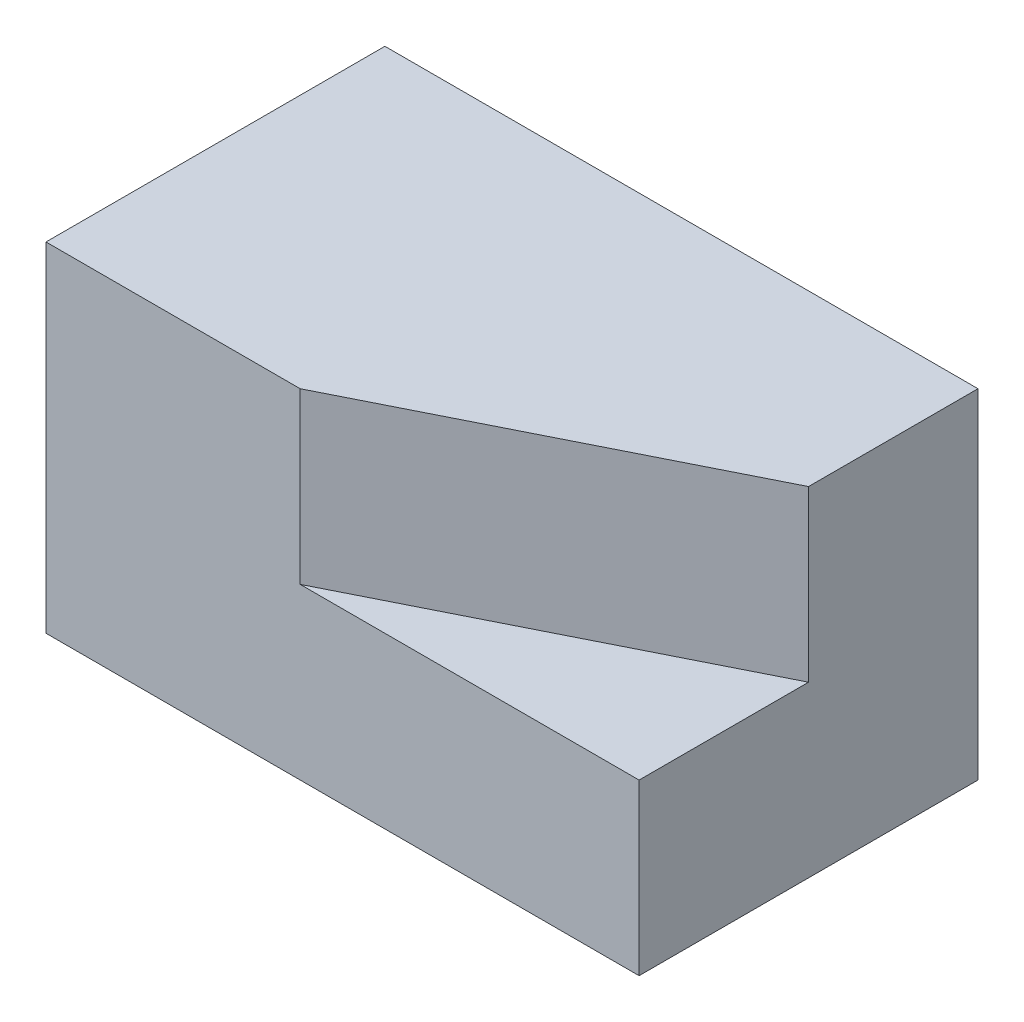
ISO-10303-21;
HEADER;
FILE_DESCRIPTION(('STEP AP214'),'2;1');
FILE_NAME('part.step','',(''),(''),'','','');
FILE_SCHEMA(('AUTOMOTIVE_DESIGN { 1 0 10303 214 1 1 1 1 }'));
ENDSEC;
DATA;
#1=APPLICATION_CONTEXT('core data for automotive mechanical design processes');
#2=APPLICATION_PROTOCOL_DEFINITION('international standard','automotive_design',2000,#1);
#3=PRODUCT_CONTEXT('',#1,'mechanical');
#4=PRODUCT('Part','Part','',(#3));
#5=PRODUCT_RELATED_PRODUCT_CATEGORY('part','',(#4));
#6=PRODUCT_DEFINITION_FORMATION('','',#4);
#7=PRODUCT_DEFINITION_CONTEXT('part definition',#1,'design');
#8=PRODUCT_DEFINITION('design','',#6,#7);
#9=PRODUCT_DEFINITION_SHAPE('','',#8);
#10=(LENGTH_UNIT() NAMED_UNIT(*) SI_UNIT(.MILLI.,.METRE.));
#11=(NAMED_UNIT(*) PLANE_ANGLE_UNIT() SI_UNIT($,.RADIAN.));
#12=(NAMED_UNIT(*) SI_UNIT($,.STERADIAN.) SOLID_ANGLE_UNIT());
#13=UNCERTAINTY_MEASURE_WITH_UNIT(LENGTH_MEASURE(1.E-05),#10,'distance_accuracy_value','');
#14=(GEOMETRIC_REPRESENTATION_CONTEXT(3) GLOBAL_UNCERTAINTY_ASSIGNED_CONTEXT((#13)) GLOBAL_UNIT_ASSIGNED_CONTEXT((#10,
#11,#12)) REPRESENTATION_CONTEXT('',''));
#15=CARTESIAN_POINT('',(0.,0.,0.));
#16=DIRECTION('',(0.,0.,1.));
#17=DIRECTION('',(1.,0.,0.));
#18=AXIS2_PLACEMENT_3D('',#15,#16,#17);
#19=CARTESIAN_POINT('',(0.,50.8,-101.6));
#20=DIRECTION('',(0.,1.,0.));
#21=DIRECTION('',(0.,0.,1.));
#22=AXIS2_PLACEMENT_3D('',#19,#20,#21);
#23=PLANE('',#22);
#24=DIRECTION('',(0.,0.,1.));
#25=VECTOR('',#24,1.);
#26=CARTESIAN_POINT('',(177.8,50.8,-101.6));
#27=LINE('',#26,#25);
#28=CARTESIAN_POINT('',(177.8,50.8,-50.8));
#29=VERTEX_POINT('',#28);
#30=CARTESIAN_POINT('',(177.8,50.8,0.));
#31=VERTEX_POINT('',#30);
#32=EDGE_CURVE('E11',#29,#31,#27,.T.);
#33=ORIENTED_EDGE('',*,*,#32,.F.);
#34=DIRECTION('',(0.894427190999916,0.,-0.447213595499958));
#35=VECTOR('',#34,1.);
#36=CARTESIAN_POINT('',(76.2,50.8,0.));
#37=LINE('',#36,#35);
#38=CARTESIAN_POINT('',(76.2,50.8,0.));
#39=VERTEX_POINT('',#38);
#40=EDGE_CURVE('E53',#39,#29,#37,.T.);
#41=ORIENTED_EDGE('',*,*,#40,.F.);
#42=DIRECTION('',(-1.,0.,0.));
#43=VECTOR('',#42,1.);
#44=CARTESIAN_POINT('',(0.,50.8,0.));
#45=LINE('',#44,#43);
#46=EDGE_CURVE('E128',#31,#39,#45,.T.);
#47=ORIENTED_EDGE('',*,*,#46,.F.);
#48=EDGE_LOOP('',(#33,#41,#47));
#49=FACE_BOUND('',#48,.T.);
#50=ADVANCED_FACE('F35',(#49),#23,.T.);
#51=CARTESIAN_POINT('',(0.,0.,-101.6));
#52=DIRECTION('',(-1.,0.,0.));
#53=DIRECTION('',(0.,0.,1.));
#54=AXIS2_PLACEMENT_3D('',#51,#52,#53);
#55=PLANE('',#54);
#56=DIRECTION('',(0.,-1.,0.));
#57=VECTOR('',#56,1.);
#58=CARTESIAN_POINT('',(0.,0.,0.));
#59=LINE('',#58,#57);
#60=CARTESIAN_POINT('',(0.,101.6,0.));
#61=VERTEX_POINT('',#60);
#62=CARTESIAN_POINT('',(0.,0.,0.));
#63=VERTEX_POINT('',#62);
#64=EDGE_CURVE('E98',#61,#63,#59,.T.);
#65=ORIENTED_EDGE('',*,*,#64,.F.);
#66=DIRECTION('',(0.,0.,1.));
#67=VECTOR('',#66,1.);
#68=CARTESIAN_POINT('',(0.,101.6,-101.6));
#69=LINE('',#68,#67);
#70=CARTESIAN_POINT('',(0.,101.6,-101.6));
#71=VERTEX_POINT('',#70);
#72=EDGE_CURVE('E120',#71,#61,#69,.T.);
#73=ORIENTED_EDGE('',*,*,#72,.F.);
#74=DIRECTION('',(0.,-1.,0.));
#75=VECTOR('',#74,1.);
#76=CARTESIAN_POINT('',(0.,0.,-101.6));
#77=LINE('',#76,#75);
#78=CARTESIAN_POINT('',(0.,0.,-101.6));
#79=VERTEX_POINT('',#78);
#80=EDGE_CURVE('E93',#71,#79,#77,.T.);
#81=ORIENTED_EDGE('',*,*,#80,.T.);
#82=DIRECTION('',(0.,0.,1.));
#83=VECTOR('',#82,1.);
#84=CARTESIAN_POINT('',(0.,0.,-101.6));
#85=LINE('',#84,#83);
#86=EDGE_CURVE('E39',#79,#63,#85,.T.);
#87=ORIENTED_EDGE('',*,*,#86,.T.);
#88=EDGE_LOOP('',(#65,#73,#81,#87));
#89=FACE_BOUND('',#88,.T.);
#90=ADVANCED_FACE('F37',(#89),#55,.T.);
#91=CARTESIAN_POINT('',(177.8,0.,-101.6));
#92=DIRECTION('',(1.,0.,0.));
#93=DIRECTION('',(0.,0.,-1.));
#94=AXIS2_PLACEMENT_3D('',#91,#92,#93);
#95=PLANE('',#94);
#96=DIRECTION('',(0.,1.,0.));
#97=VECTOR('',#96,1.);
#98=CARTESIAN_POINT('',(177.8,0.,0.));
#99=LINE('',#98,#97);
#100=CARTESIAN_POINT('',(177.8,0.,0.));
#101=VERTEX_POINT('',#100);
#102=EDGE_CURVE('E135',#101,#31,#99,.T.);
#103=ORIENTED_EDGE('',*,*,#102,.F.);
#104=DIRECTION('',(0.,0.,1.));
#105=VECTOR('',#104,1.);
#106=CARTESIAN_POINT('',(177.8,0.,-101.6));
#107=LINE('',#106,#105);
#108=CARTESIAN_POINT('',(177.8,0.,-101.6));
#109=VERTEX_POINT('',#108);
#110=EDGE_CURVE('E44',#109,#101,#107,.T.);
#111=ORIENTED_EDGE('',*,*,#110,.F.);
#112=DIRECTION('',(0.,1.,0.));
#113=VECTOR('',#112,1.);
#114=CARTESIAN_POINT('',(177.8,0.,-101.6));
#115=LINE('',#114,#113);
#116=CARTESIAN_POINT('',(177.8,101.6,-101.6));
#117=VERTEX_POINT('',#116);
#118=EDGE_CURVE('E90',#109,#117,#115,.T.);
#119=ORIENTED_EDGE('',*,*,#118,.T.);
#120=DIRECTION('',(0.,0.,-1.));
#121=VECTOR('',#120,1.);
#122=CARTESIAN_POINT('',(177.8,101.6,-50.8));
#123=LINE('',#122,#121);
#124=CARTESIAN_POINT('',(177.8,101.6,-50.8));
#125=VERTEX_POINT('',#124);
#126=EDGE_CURVE('E106',#125,#117,#123,.T.);
#127=ORIENTED_EDGE('',*,*,#126,.F.);
#128=DIRECTION('',(0.,-1.,0.));
#129=VECTOR('',#128,1.);
#130=CARTESIAN_POINT('',(177.8,101.6,-50.8));
#131=LINE('',#130,#129);
#132=EDGE_CURVE('E115',#125,#29,#131,.T.);
#133=ORIENTED_EDGE('',*,*,#132,.T.);
#134=ORIENTED_EDGE('',*,*,#32,.T.);
#135=EDGE_LOOP('',(#103,#111,#119,#127,#133,#134));
#136=FACE_BOUND('',#135,.T.);
#137=ADVANCED_FACE('F104',(#136),#95,.T.);
#138=CARTESIAN_POINT('',(0.,0.,-101.6));
#139=DIRECTION('',(0.,-1.,0.));
#140=DIRECTION('',(0.,0.,-1.));
#141=AXIS2_PLACEMENT_3D('',#138,#139,#140);
#142=PLANE('',#141);
#143=DIRECTION('',(1.,0.,0.));
#144=VECTOR('',#143,1.);
#145=CARTESIAN_POINT('',(0.,0.,0.));
#146=LINE('',#145,#144);
#147=EDGE_CURVE('E132',#63,#101,#146,.T.);
#148=ORIENTED_EDGE('',*,*,#147,.F.);
#149=ORIENTED_EDGE('',*,*,#86,.F.);
#150=DIRECTION('',(1.,0.,0.));
#151=VECTOR('',#150,1.);
#152=CARTESIAN_POINT('',(0.,0.,-101.6));
#153=LINE('',#152,#151);
#154=EDGE_CURVE('E107',#79,#109,#153,.T.);
#155=ORIENTED_EDGE('',*,*,#154,.T.);
#156=ORIENTED_EDGE('',*,*,#110,.T.);
#157=EDGE_LOOP('',(#148,#149,#155,#156));
#158=FACE_BOUND('',#157,.T.);
#159=ADVANCED_FACE('F141',(#158),#142,.T.);
#160=CARTESIAN_POINT('',(0.,0.,-101.6));
#161=DIRECTION('',(0.,0.,-1.));
#162=DIRECTION('',(-1.,0.,0.));
#163=AXIS2_PLACEMENT_3D('',#160,#161,#162);
#164=PLANE('',#163);
#165=DIRECTION('',(-1.,0.,0.));
#166=VECTOR('',#165,1.);
#167=CARTESIAN_POINT('',(76.2,101.6,-101.6));
#168=LINE('',#167,#166);
#169=EDGE_CURVE('E86',#117,#71,#168,.T.);
#170=ORIENTED_EDGE('',*,*,#169,.F.);
#171=ORIENTED_EDGE('',*,*,#118,.F.);
#172=ORIENTED_EDGE('',*,*,#154,.F.);
#173=ORIENTED_EDGE('',*,*,#80,.F.);
#174=EDGE_LOOP('',(#170,#171,#172,#173));
#175=FACE_BOUND('',#174,.T.);
#176=ADVANCED_FACE('F88',(#175),#164,.T.);
#177=CARTESIAN_POINT('',(0.,0.,0.));
#178=DIRECTION('',(0.,0.,-1.));
#179=DIRECTION('',(-1.,0.,0.));
#180=AXIS2_PLACEMENT_3D('',#177,#178,#179);
#181=PLANE('',#180);
#182=ORIENTED_EDGE('',*,*,#64,.T.);
#183=ORIENTED_EDGE('',*,*,#147,.T.);
#184=ORIENTED_EDGE('',*,*,#102,.T.);
#185=ORIENTED_EDGE('',*,*,#46,.T.);
#186=DIRECTION('',(0.,-1.,0.));
#187=VECTOR('',#186,1.);
#188=CARTESIAN_POINT('',(76.2,101.6,0.));
#189=LINE('',#188,#187);
#190=CARTESIAN_POINT('',(76.2,101.6,0.));
#191=VERTEX_POINT('',#190);
#192=EDGE_CURVE('E121',#191,#39,#189,.T.);
#193=ORIENTED_EDGE('',*,*,#192,.F.);
#194=DIRECTION('',(-1.,0.,0.));
#195=VECTOR('',#194,1.);
#196=CARTESIAN_POINT('',(76.2,101.6,0.));
#197=LINE('',#196,#195);
#198=EDGE_CURVE('E99',#191,#61,#197,.T.);
#199=ORIENTED_EDGE('',*,*,#198,.T.);
#200=EDGE_LOOP('',(#182,#183,#184,#185,#193,#199));
#201=FACE_BOUND('',#200,.T.);
#202=ADVANCED_FACE('F143',(#201),#181,.F.);
#203=CARTESIAN_POINT('',(76.2,101.6,-101.6));
#204=DIRECTION('',(0.,-1.,0.));
#205=DIRECTION('',(0.,0.,-1.));
#206=AXIS2_PLACEMENT_3D('',#203,#204,#205);
#207=PLANE('',#206);
#208=ORIENTED_EDGE('',*,*,#72,.T.);
#209=ORIENTED_EDGE('',*,*,#198,.F.);
#210=DIRECTION('',(0.894427190999916,0.,-0.447213595499958));
#211=VECTOR('',#210,1.);
#212=CARTESIAN_POINT('',(76.2,101.6,0.));
#213=LINE('',#212,#211);
#214=EDGE_CURVE('E112',#191,#125,#213,.T.);
#215=ORIENTED_EDGE('',*,*,#214,.T.);
#216=ORIENTED_EDGE('',*,*,#126,.T.);
#217=ORIENTED_EDGE('',*,*,#169,.T.);
#218=EDGE_LOOP('',(#208,#209,#215,#216,#217));
#219=FACE_BOUND('',#218,.T.);
#220=ADVANCED_FACE('F109',(#219),#207,.F.);
#221=CARTESIAN_POINT('',(76.2,101.6,0.));
#222=DIRECTION('',(-0.447213595499958,0.,-0.894427190999916));
#223=DIRECTION('',(-0.894427190999916,0.,0.447213595499958));
#224=AXIS2_PLACEMENT_3D('',#221,#222,#223);
#225=PLANE('',#224);
#226=ORIENTED_EDGE('',*,*,#40,.T.);
#227=ORIENTED_EDGE('',*,*,#132,.F.);
#228=ORIENTED_EDGE('',*,*,#214,.F.);
#229=ORIENTED_EDGE('',*,*,#192,.T.);
#230=EDGE_LOOP('',(#226,#227,#228,#229));
#231=FACE_BOUND('',#230,.T.);
#232=ADVANCED_FACE('F145',(#231),#225,.F.);
#233=CLOSED_SHELL('',(#50,#90,#137,#159,#176,#202,#220,#232));
#234=MANIFOLD_SOLID_BREP('B2',#233);
#235=ADVANCED_BREP_SHAPE_REPRESENTATION('',(#18,#234),#14);
#236=SHAPE_DEFINITION_REPRESENTATION(#9,#235);
ENDSEC;
END-ISO-10303-21;
